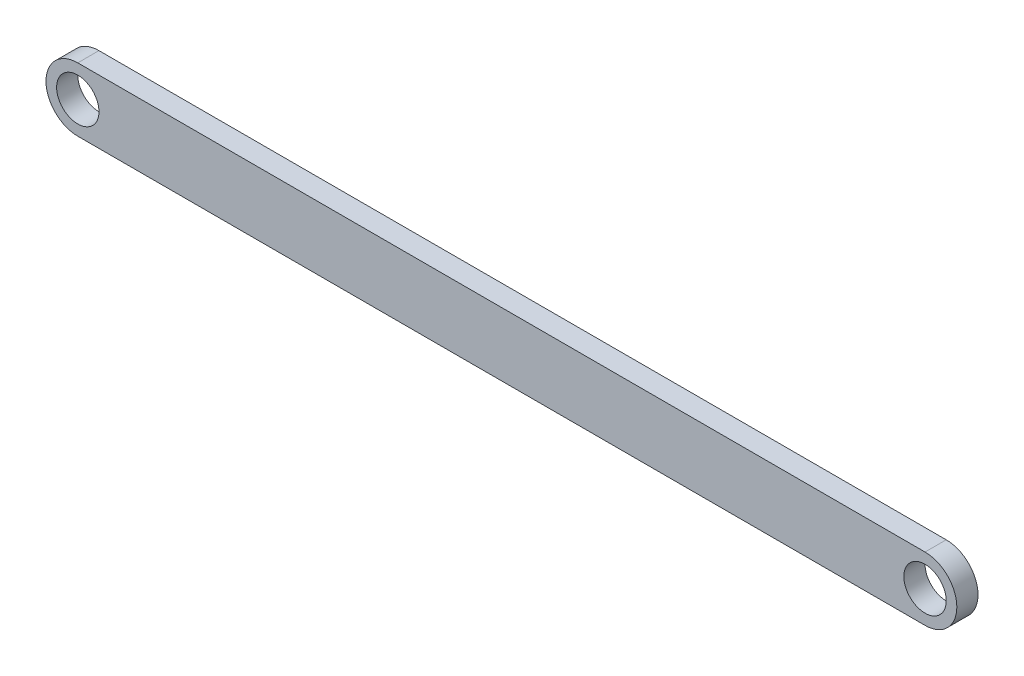
ISO-10303-21;
HEADER;
FILE_DESCRIPTION(('STEP AP214'),'2;1');
FILE_NAME('part.step','',(''),(''),'','','');
FILE_SCHEMA(('AUTOMOTIVE_DESIGN { 1 0 10303 214 1 1 1 1 }'));
ENDSEC;
DATA;
#1=APPLICATION_CONTEXT('core data for automotive mechanical design processes');
#2=APPLICATION_PROTOCOL_DEFINITION('international standard','automotive_design',2000,#1);
#3=PRODUCT_CONTEXT('',#1,'mechanical');
#4=PRODUCT('Part','Part','',(#3));
#5=PRODUCT_RELATED_PRODUCT_CATEGORY('part','',(#4));
#6=PRODUCT_DEFINITION_FORMATION('','',#4);
#7=PRODUCT_DEFINITION_CONTEXT('part definition',#1,'design');
#8=PRODUCT_DEFINITION('design','',#6,#7);
#9=PRODUCT_DEFINITION_SHAPE('','',#8);
#10=(LENGTH_UNIT() NAMED_UNIT(*) SI_UNIT(.MILLI.,.METRE.));
#11=(NAMED_UNIT(*) PLANE_ANGLE_UNIT() SI_UNIT($,.RADIAN.));
#12=(NAMED_UNIT(*) SI_UNIT($,.STERADIAN.) SOLID_ANGLE_UNIT());
#13=UNCERTAINTY_MEASURE_WITH_UNIT(LENGTH_MEASURE(1.E-05),#10,'distance_accuracy_value','');
#14=(GEOMETRIC_REPRESENTATION_CONTEXT(3) GLOBAL_UNCERTAINTY_ASSIGNED_CONTEXT((#13)) GLOBAL_UNIT_ASSIGNED_CONTEXT((#10,
#11,#12)) REPRESENTATION_CONTEXT('',''));
#15=CARTESIAN_POINT('',(0.,0.,0.));
#16=DIRECTION('',(0.,0.,1.));
#17=DIRECTION('',(1.,0.,0.));
#18=AXIS2_PLACEMENT_3D('',#15,#16,#17);
#19=CARTESIAN_POINT('',(-43.692939908895,0.,2.));
#20=DIRECTION('',(0.,0.,1.));
#21=DIRECTION('',(1.,0.,0.));
#22=AXIS2_PLACEMENT_3D('',#19,#20,#21);
#23=PLANE('',#22);
#24=CARTESIAN_POINT('',(36.307060091105,0.,2.));
#25=DIRECTION('',(0.,0.,1.));
#26=DIRECTION('',(1.,0.,0.));
#27=AXIS2_PLACEMENT_3D('',#24,#25,#26);
#28=CIRCLE('',#27,2.);
#29=CARTESIAN_POINT('',(38.307060091105,0.,2.));
#30=VERTEX_POINT('',#29);
#31=EDGE_CURVE('E98',#30,#30,#28,.T.);
#32=ORIENTED_EDGE('',*,*,#31,.F.);
#33=EDGE_LOOP('',(#32));
#34=FACE_BOUND('',#33,.T.);
#35=CARTESIAN_POINT('',(-43.692939908895,0.,2.));
#36=DIRECTION('',(0.,0.,1.));
#37=DIRECTION('',(1.,0.,0.));
#38=AXIS2_PLACEMENT_3D('',#35,#36,#37);
#39=CIRCLE('',#38,3.);
#40=CARTESIAN_POINT('',(-43.692939908895,3.,2.));
#41=VERTEX_POINT('',#40);
#42=CARTESIAN_POINT('',(-43.692939908895,-3.,2.));
#43=VERTEX_POINT('',#42);
#44=EDGE_CURVE('E83',#41,#43,#39,.T.);
#45=ORIENTED_EDGE('',*,*,#44,.T.);
#46=DIRECTION('',(1.,0.,0.));
#47=VECTOR('',#46,1.);
#48=CARTESIAN_POINT('',(-43.692939908895,-3.,2.));
#49=LINE('',#48,#47);
#50=CARTESIAN_POINT('',(36.307060091105,-3.,2.));
#51=VERTEX_POINT('',#50);
#52=EDGE_CURVE('E78',#43,#51,#49,.T.);
#53=ORIENTED_EDGE('',*,*,#52,.T.);
#54=CARTESIAN_POINT('',(36.307060091105,0.,2.));
#55=DIRECTION('',(0.,0.,1.));
#56=DIRECTION('',(1.,0.,0.));
#57=AXIS2_PLACEMENT_3D('',#54,#55,#56);
#58=CIRCLE('',#57,3.);
#59=CARTESIAN_POINT('',(36.307060091105,3.,2.));
#60=VERTEX_POINT('',#59);
#61=EDGE_CURVE('E81',#51,#60,#58,.T.);
#62=ORIENTED_EDGE('',*,*,#61,.T.);
#63=DIRECTION('',(-1.,0.,0.));
#64=VECTOR('',#63,1.);
#65=CARTESIAN_POINT('',(-43.692939908895,3.,2.));
#66=LINE('',#65,#64);
#67=EDGE_CURVE('E48',#60,#41,#66,.T.);
#68=ORIENTED_EDGE('',*,*,#67,.T.);
#69=EDGE_LOOP('',(#45,#53,#62,#68));
#70=FACE_BOUND('',#69,.T.);
#71=CARTESIAN_POINT('',(-43.692939908895,0.,2.));
#72=DIRECTION('',(0.,0.,1.));
#73=DIRECTION('',(1.,0.,0.));
#74=AXIS2_PLACEMENT_3D('',#71,#72,#73);
#75=CIRCLE('',#74,2.);
#76=CARTESIAN_POINT('',(-41.692939908895,0.,2.));
#77=VERTEX_POINT('',#76);
#78=EDGE_CURVE('E113',#77,#77,#75,.T.);
#79=ORIENTED_EDGE('',*,*,#78,.F.);
#80=EDGE_LOOP('',(#79));
#81=FACE_BOUND('',#80,.T.);
#82=ADVANCED_FACE('F31',(#34,#70,#81),#23,.T.);
#83=CARTESIAN_POINT('',(-43.692939908895,0.,0.));
#84=DIRECTION('',(0.,0.,1.));
#85=DIRECTION('',(1.,0.,0.));
#86=AXIS2_PLACEMENT_3D('',#83,#84,#85);
#87=PLANE('',#86);
#88=CARTESIAN_POINT('',(36.307060091105,0.,0.));
#89=DIRECTION('',(0.,0.,1.));
#90=DIRECTION('',(1.,0.,0.));
#91=AXIS2_PLACEMENT_3D('',#88,#89,#90);
#92=CIRCLE('',#91,2.);
#93=CARTESIAN_POINT('',(38.307060091105,0.,0.));
#94=VERTEX_POINT('',#93);
#95=EDGE_CURVE('E110',#94,#94,#92,.T.);
#96=ORIENTED_EDGE('',*,*,#95,.T.);
#97=EDGE_LOOP('',(#96));
#98=FACE_BOUND('',#97,.T.);
#99=CARTESIAN_POINT('',(-43.692939908895,0.,0.));
#100=DIRECTION('',(0.,0.,1.));
#101=DIRECTION('',(1.,0.,0.));
#102=AXIS2_PLACEMENT_3D('',#99,#100,#101);
#103=CIRCLE('',#102,3.);
#104=CARTESIAN_POINT('',(-43.692939908895,3.,0.));
#105=VERTEX_POINT('',#104);
#106=CARTESIAN_POINT('',(-43.692939908895,-3.,0.));
#107=VERTEX_POINT('',#106);
#108=EDGE_CURVE('E95',#105,#107,#103,.T.);
#109=ORIENTED_EDGE('',*,*,#108,.F.);
#110=DIRECTION('',(-1.,0.,0.));
#111=VECTOR('',#110,1.);
#112=CARTESIAN_POINT('',(-43.692939908895,3.,0.));
#113=LINE('',#112,#111);
#114=CARTESIAN_POINT('',(36.307060091105,3.,0.));
#115=VERTEX_POINT('',#114);
#116=EDGE_CURVE('E71',#115,#105,#113,.T.);
#117=ORIENTED_EDGE('',*,*,#116,.F.);
#118=CARTESIAN_POINT('',(36.307060091105,0.,0.));
#119=DIRECTION('',(0.,0.,1.));
#120=DIRECTION('',(1.,0.,0.));
#121=AXIS2_PLACEMENT_3D('',#118,#119,#120);
#122=CIRCLE('',#121,3.);
#123=CARTESIAN_POINT('',(36.307060091105,-3.,0.));
#124=VERTEX_POINT('',#123);
#125=EDGE_CURVE('E65',#124,#115,#122,.T.);
#126=ORIENTED_EDGE('',*,*,#125,.F.);
#127=DIRECTION('',(1.,0.,0.));
#128=VECTOR('',#127,1.);
#129=CARTESIAN_POINT('',(-43.692939908895,-3.,0.));
#130=LINE('',#129,#128);
#131=EDGE_CURVE('E87',#107,#124,#130,.T.);
#132=ORIENTED_EDGE('',*,*,#131,.F.);
#133=EDGE_LOOP('',(#109,#117,#126,#132));
#134=FACE_BOUND('',#133,.T.);
#135=CARTESIAN_POINT('',(-43.692939908895,0.,0.));
#136=DIRECTION('',(0.,0.,1.));
#137=DIRECTION('',(1.,0.,0.));
#138=AXIS2_PLACEMENT_3D('',#135,#136,#137);
#139=CIRCLE('',#138,2.);
#140=CARTESIAN_POINT('',(-41.692939908895,0.,0.));
#141=VERTEX_POINT('',#140);
#142=EDGE_CURVE('E116',#141,#141,#139,.T.);
#143=ORIENTED_EDGE('',*,*,#142,.T.);
#144=EDGE_LOOP('',(#143));
#145=FACE_BOUND('',#144,.T.);
#146=ADVANCED_FACE('F106',(#98,#134,#145),#87,.F.);
#147=CARTESIAN_POINT('',(-43.692939908895,0.,2.));
#148=DIRECTION('',(0.,0.,-1.));
#149=DIRECTION('',(-1.,0.,0.));
#150=AXIS2_PLACEMENT_3D('',#147,#148,#149);
#151=CYLINDRICAL_SURFACE('',#150,3.);
#152=ORIENTED_EDGE('',*,*,#108,.T.);
#153=DIRECTION('',(0.,0.,-1.));
#154=VECTOR('',#153,1.);
#155=CARTESIAN_POINT('',(-43.692939908895,-3.,2.));
#156=LINE('',#155,#154);
#157=EDGE_CURVE('E11',#43,#107,#156,.T.);
#158=ORIENTED_EDGE('',*,*,#157,.F.);
#159=ORIENTED_EDGE('',*,*,#44,.F.);
#160=DIRECTION('',(0.,0.,-1.));
#161=VECTOR('',#160,1.);
#162=CARTESIAN_POINT('',(-43.692939908895,3.,2.));
#163=LINE('',#162,#161);
#164=EDGE_CURVE('E91',#41,#105,#163,.T.);
#165=ORIENTED_EDGE('',*,*,#164,.T.);
#166=EDGE_LOOP('',(#152,#158,#159,#165));
#167=FACE_BOUND('',#166,.T.);
#168=ADVANCED_FACE('F33',(#167),#151,.T.);
#169=CARTESIAN_POINT('',(-43.692939908895,-3.,2.));
#170=DIRECTION('',(0.,1.,0.));
#171=DIRECTION('',(0.,0.,1.));
#172=AXIS2_PLACEMENT_3D('',#169,#170,#171);
#173=PLANE('',#172);
#174=ORIENTED_EDGE('',*,*,#131,.T.);
#175=DIRECTION('',(0.,0.,-1.));
#176=VECTOR('',#175,1.);
#177=CARTESIAN_POINT('',(36.307060091105,-3.,2.));
#178=LINE('',#177,#176);
#179=EDGE_CURVE('E40',#51,#124,#178,.T.);
#180=ORIENTED_EDGE('',*,*,#179,.F.);
#181=ORIENTED_EDGE('',*,*,#52,.F.);
#182=ORIENTED_EDGE('',*,*,#157,.T.);
#183=EDGE_LOOP('',(#174,#180,#181,#182));
#184=FACE_BOUND('',#183,.T.);
#185=ADVANCED_FACE('F86',(#184),#173,.F.);
#186=CARTESIAN_POINT('',(36.307060091105,0.,2.));
#187=DIRECTION('',(0.,0.,-1.));
#188=DIRECTION('',(-1.,0.,0.));
#189=AXIS2_PLACEMENT_3D('',#186,#187,#188);
#190=CYLINDRICAL_SURFACE('',#189,3.);
#191=ORIENTED_EDGE('',*,*,#125,.T.);
#192=DIRECTION('',(0.,0.,-1.));
#193=VECTOR('',#192,1.);
#194=CARTESIAN_POINT('',(36.307060091105,3.,2.));
#195=LINE('',#194,#193);
#196=EDGE_CURVE('E88',#60,#115,#195,.T.);
#197=ORIENTED_EDGE('',*,*,#196,.F.);
#198=ORIENTED_EDGE('',*,*,#61,.F.);
#199=ORIENTED_EDGE('',*,*,#179,.T.);
#200=EDGE_LOOP('',(#191,#197,#198,#199));
#201=FACE_BOUND('',#200,.T.);
#202=ADVANCED_FACE('F89',(#201),#190,.T.);
#203=CARTESIAN_POINT('',(-43.692939908895,3.,2.));
#204=DIRECTION('',(0.,-1.,0.));
#205=DIRECTION('',(0.,0.,-1.));
#206=AXIS2_PLACEMENT_3D('',#203,#204,#205);
#207=PLANE('',#206);
#208=ORIENTED_EDGE('',*,*,#116,.T.);
#209=ORIENTED_EDGE('',*,*,#164,.F.);
#210=ORIENTED_EDGE('',*,*,#67,.F.);
#211=ORIENTED_EDGE('',*,*,#196,.T.);
#212=EDGE_LOOP('',(#208,#209,#210,#211));
#213=FACE_BOUND('',#212,.T.);
#214=ADVANCED_FACE('F103',(#213),#207,.F.);
#215=CARTESIAN_POINT('',(36.307060091105,0.,2.));
#216=DIRECTION('',(0.,0.,-1.));
#217=DIRECTION('',(-1.,0.,0.));
#218=AXIS2_PLACEMENT_3D('',#215,#216,#217);
#219=CYLINDRICAL_SURFACE('',#218,2.);
#220=ORIENTED_EDGE('',*,*,#31,.T.);
#221=EDGE_LOOP('',(#220));
#222=FACE_BOUND('',#221,.T.);
#223=ORIENTED_EDGE('',*,*,#95,.F.);
#224=EDGE_LOOP('',(#223));
#225=FACE_BOUND('',#224,.T.);
#226=ADVANCED_FACE('F134',(#222,#225),#219,.F.);
#227=CARTESIAN_POINT('',(-43.692939908895,0.,2.));
#228=DIRECTION('',(0.,0.,-1.));
#229=DIRECTION('',(-1.,0.,0.));
#230=AXIS2_PLACEMENT_3D('',#227,#228,#229);
#231=CYLINDRICAL_SURFACE('',#230,2.);
#232=ORIENTED_EDGE('',*,*,#78,.T.);
#233=EDGE_LOOP('',(#232));
#234=FACE_BOUND('',#233,.T.);
#235=ORIENTED_EDGE('',*,*,#142,.F.);
#236=EDGE_LOOP('',(#235));
#237=FACE_BOUND('',#236,.T.);
#238=ADVANCED_FACE('F122',(#234,#237),#231,.F.);
#239=CLOSED_SHELL('',(#82,#146,#168,#185,#202,#214,#226,#238));
#240=MANIFOLD_SOLID_BREP('B2',#239);
#241=ADVANCED_BREP_SHAPE_REPRESENTATION('',(#18,#240),#14);
#242=SHAPE_DEFINITION_REPRESENTATION(#9,#241);
ENDSEC;
END-ISO-10303-21;
